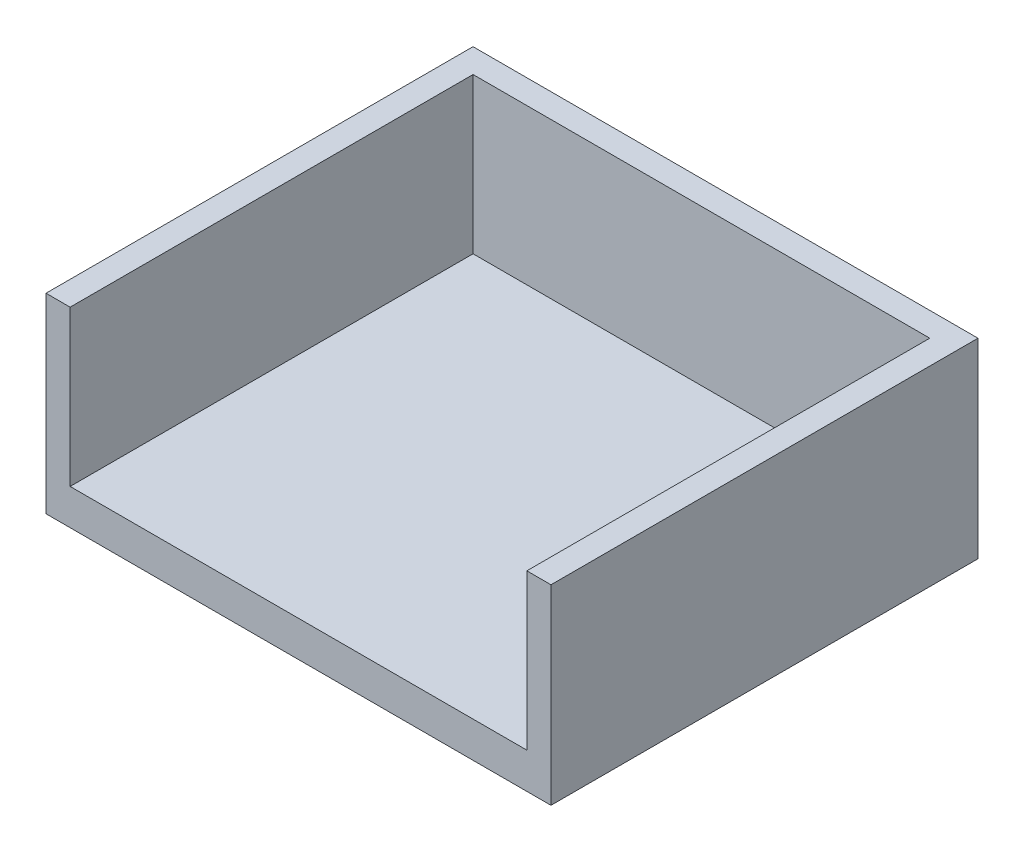
ISO-10303-21;
HEADER;
FILE_DESCRIPTION(('STEP AP214'),'2;1');
FILE_NAME('part.step','',(''),(''),'','','');
FILE_SCHEMA(('AUTOMOTIVE_DESIGN { 1 0 10303 214 1 1 1 1 }'));
ENDSEC;
DATA;
#1=APPLICATION_CONTEXT('core data for automotive mechanical design processes');
#2=APPLICATION_PROTOCOL_DEFINITION('international standard','automotive_design',2000,#1);
#3=PRODUCT_CONTEXT('',#1,'mechanical');
#4=PRODUCT('Part','Part','',(#3));
#5=PRODUCT_RELATED_PRODUCT_CATEGORY('part','',(#4));
#6=PRODUCT_DEFINITION_FORMATION('','',#4);
#7=PRODUCT_DEFINITION_CONTEXT('part definition',#1,'design');
#8=PRODUCT_DEFINITION('design','',#6,#7);
#9=PRODUCT_DEFINITION_SHAPE('','',#8);
#10=(LENGTH_UNIT() NAMED_UNIT(*) SI_UNIT(.MILLI.,.METRE.));
#11=(NAMED_UNIT(*) PLANE_ANGLE_UNIT() SI_UNIT($,.RADIAN.));
#12=(NAMED_UNIT(*) SI_UNIT($,.STERADIAN.) SOLID_ANGLE_UNIT());
#13=UNCERTAINTY_MEASURE_WITH_UNIT(LENGTH_MEASURE(1.E-05),#10,'distance_accuracy_value','');
#14=(GEOMETRIC_REPRESENTATION_CONTEXT(3) GLOBAL_UNCERTAINTY_ASSIGNED_CONTEXT((#13)) GLOBAL_UNIT_ASSIGNED_CONTEXT((#10,
#11,#12)) REPRESENTATION_CONTEXT('',''));
#15=CARTESIAN_POINT('',(0.,0.,0.));
#16=DIRECTION('',(0.,0.,1.));
#17=DIRECTION('',(1.,0.,0.));
#18=AXIS2_PLACEMENT_3D('',#15,#16,#17);
#19=CARTESIAN_POINT('',(-56.505,42.75,47.785));
#20=DIRECTION('',(1.,0.,0.));
#21=DIRECTION('',(0.,0.,-1.));
#22=AXIS2_PLACEMENT_3D('',#19,#20,#21);
#23=PLANE('',#22);
#24=DIRECTION('',(0.,0.,1.));
#25=VECTOR('',#24,1.);
#26=CARTESIAN_POINT('',(-56.505,0.,47.785));
#27=LINE('',#26,#25);
#28=CARTESIAN_POINT('',(-56.505,0.,-47.785));
#29=VERTEX_POINT('',#28);
#30=CARTESIAN_POINT('',(-56.505,0.,47.785));
#31=VERTEX_POINT('',#30);
#32=EDGE_CURVE('E158',#29,#31,#27,.T.);
#33=ORIENTED_EDGE('',*,*,#32,.T.);
#34=DIRECTION('',(0.,-1.,0.));
#35=VECTOR('',#34,1.);
#36=CARTESIAN_POINT('',(-56.505,42.75,47.785));
#37=LINE('',#36,#35);
#38=CARTESIAN_POINT('',(-56.505,42.75,47.785));
#39=VERTEX_POINT('',#38);
#40=EDGE_CURVE('E11',#39,#31,#37,.T.);
#41=ORIENTED_EDGE('',*,*,#40,.F.);
#42=DIRECTION('',(0.,0.,1.));
#43=VECTOR('',#42,1.);
#44=CARTESIAN_POINT('',(-56.505,42.75,47.785));
#45=LINE('',#44,#43);
#46=CARTESIAN_POINT('',(-56.505,42.75,-47.785));
#47=VERTEX_POINT('',#46);
#48=EDGE_CURVE('E145',#47,#39,#45,.T.);
#49=ORIENTED_EDGE('',*,*,#48,.F.);
#50=DIRECTION('',(0.,-1.,0.));
#51=VECTOR('',#50,1.);
#52=CARTESIAN_POINT('',(-56.505,42.75,-47.785));
#53=LINE('',#52,#51);
#54=EDGE_CURVE('E157',#47,#29,#53,.T.);
#55=ORIENTED_EDGE('',*,*,#54,.T.);
#56=EDGE_LOOP('',(#33,#41,#49,#55));
#57=FACE_BOUND('',#56,.T.);
#58=ADVANCED_FACE('F44',(#57),#23,.F.);
#59=CARTESIAN_POINT('',(56.505,42.75,47.785));
#60=DIRECTION('',(0.,0.,-1.));
#61=DIRECTION('',(-1.,0.,0.));
#62=AXIS2_PLACEMENT_3D('',#59,#60,#61);
#63=PLANE('',#62);
#64=DIRECTION('',(1.,0.,0.));
#65=VECTOR('',#64,1.);
#66=CARTESIAN_POINT('',(56.505,8.,47.785));
#67=LINE('',#66,#65);
#68=CARTESIAN_POINT('',(-51.105,8.,47.785));
#69=VERTEX_POINT('',#68);
#70=CARTESIAN_POINT('',(51.105,8.,47.785));
#71=VERTEX_POINT('',#70);
#72=EDGE_CURVE('E313',#69,#71,#67,.T.);
#73=ORIENTED_EDGE('',*,*,#72,.F.);
#74=DIRECTION('',(0.,1.,0.));
#75=VECTOR('',#74,1.);
#76=CARTESIAN_POINT('',(-51.105,42.75,47.785));
#77=LINE('',#76,#75);
#78=CARTESIAN_POINT('',(-51.105,42.75,47.785));
#79=VERTEX_POINT('',#78);
#80=EDGE_CURVE('E140',#69,#79,#77,.T.);
#81=ORIENTED_EDGE('',*,*,#80,.T.);
#82=DIRECTION('',(1.,0.,0.));
#83=VECTOR('',#82,1.);
#84=CARTESIAN_POINT('',(56.505,42.75,47.785));
#85=LINE('',#84,#83);
#86=EDGE_CURVE('E92',#39,#79,#85,.T.);
#87=ORIENTED_EDGE('',*,*,#86,.F.);
#88=ORIENTED_EDGE('',*,*,#40,.T.);
#89=DIRECTION('',(1.,0.,0.));
#90=VECTOR('',#89,1.);
#91=CARTESIAN_POINT('',(56.505,0.,47.785));
#92=LINE('',#91,#90);
#93=CARTESIAN_POINT('',(56.505,0.,47.785));
#94=VERTEX_POINT('',#93);
#95=EDGE_CURVE('E162',#31,#94,#92,.T.);
#96=ORIENTED_EDGE('',*,*,#95,.T.);
#97=DIRECTION('',(0.,-1.,0.));
#98=VECTOR('',#97,1.);
#99=CARTESIAN_POINT('',(56.505,42.75,47.785));
#100=LINE('',#99,#98);
#101=CARTESIAN_POINT('',(56.505,42.75,47.785));
#102=VERTEX_POINT('',#101);
#103=EDGE_CURVE('E53',#102,#94,#100,.T.);
#104=ORIENTED_EDGE('',*,*,#103,.F.);
#105=CARTESIAN_POINT('',(51.105,42.75,47.785));
#106=VERTEX_POINT('',#105);
#107=EDGE_CURVE('E122',#106,#102,#85,.T.);
#108=ORIENTED_EDGE('',*,*,#107,.F.);
#109=DIRECTION('',(0.,-1.,0.));
#110=VECTOR('',#109,1.);
#111=CARTESIAN_POINT('',(51.105,42.75,47.785));
#112=LINE('',#111,#110);
#113=EDGE_CURVE('E134',#106,#71,#112,.T.);
#114=ORIENTED_EDGE('',*,*,#113,.T.);
#115=EDGE_LOOP('',(#73,#81,#87,#88,#96,#104,#108,#114));
#116=FACE_BOUND('',#115,.T.);
#117=ADVANCED_FACE('F142',(#116),#63,.F.);
#118=CARTESIAN_POINT('',(56.505,42.75,47.785));
#119=DIRECTION('',(-1.,0.,0.));
#120=DIRECTION('',(0.,0.,1.));
#121=AXIS2_PLACEMENT_3D('',#118,#119,#120);
#122=PLANE('',#121);
#123=DIRECTION('',(0.,0.,-1.));
#124=VECTOR('',#123,1.);
#125=CARTESIAN_POINT('',(56.505,0.,47.785));
#126=LINE('',#125,#124);
#127=CARTESIAN_POINT('',(56.505,0.,-47.785));
#128=VERTEX_POINT('',#127);
#129=EDGE_CURVE('E79',#94,#128,#126,.T.);
#130=ORIENTED_EDGE('',*,*,#129,.T.);
#131=DIRECTION('',(0.,-1.,0.));
#132=VECTOR('',#131,1.);
#133=CARTESIAN_POINT('',(56.505,42.75,-47.785));
#134=LINE('',#133,#132);
#135=CARTESIAN_POINT('',(56.505,42.75,-47.785));
#136=VERTEX_POINT('',#135);
#137=EDGE_CURVE('E172',#136,#128,#134,.T.);
#138=ORIENTED_EDGE('',*,*,#137,.F.);
#139=DIRECTION('',(0.,0.,-1.));
#140=VECTOR('',#139,1.);
#141=CARTESIAN_POINT('',(56.505,42.75,47.785));
#142=LINE('',#141,#140);
#143=EDGE_CURVE('E149',#102,#136,#142,.T.);
#144=ORIENTED_EDGE('',*,*,#143,.F.);
#145=ORIENTED_EDGE('',*,*,#103,.T.);
#146=EDGE_LOOP('',(#130,#138,#144,#145));
#147=FACE_BOUND('',#146,.T.);
#148=ADVANCED_FACE('F175',(#147),#122,.F.);
#149=CARTESIAN_POINT('',(56.505,42.75,-47.785));
#150=DIRECTION('',(0.,0.,1.));
#151=DIRECTION('',(1.,0.,0.));
#152=AXIS2_PLACEMENT_3D('',#149,#150,#151);
#153=PLANE('',#152);
#154=DIRECTION('',(-1.,0.,0.));
#155=VECTOR('',#154,1.);
#156=CARTESIAN_POINT('',(56.505,0.,-47.785));
#157=LINE('',#156,#155);
#158=EDGE_CURVE('E85',#128,#29,#157,.T.);
#159=ORIENTED_EDGE('',*,*,#158,.T.);
#160=ORIENTED_EDGE('',*,*,#54,.F.);
#161=DIRECTION('',(-1.,0.,0.));
#162=VECTOR('',#161,1.);
#163=CARTESIAN_POINT('',(56.505,42.75,-47.785));
#164=LINE('',#163,#162);
#165=EDGE_CURVE('E61',#136,#47,#164,.T.);
#166=ORIENTED_EDGE('',*,*,#165,.F.);
#167=ORIENTED_EDGE('',*,*,#137,.T.);
#168=EDGE_LOOP('',(#159,#160,#166,#167));
#169=FACE_BOUND('',#168,.T.);
#170=ADVANCED_FACE('F182',(#169),#153,.F.);
#171=CARTESIAN_POINT('',(0.,42.75,0.));
#172=DIRECTION('',(0.,1.,0.));
#173=DIRECTION('',(0.,0.,1.));
#174=AXIS2_PLACEMENT_3D('',#171,#172,#173);
#175=PLANE('',#174);
#176=ORIENTED_EDGE('',*,*,#86,.T.);
#177=DIRECTION('',(0.,0.,1.));
#178=VECTOR('',#177,1.);
#179=CARTESIAN_POINT('',(-51.105,42.75,47.777303692476));
#180=LINE('',#179,#178);
#181=CARTESIAN_POINT('',(-51.105,42.75,-42.392696307524));
#182=VERTEX_POINT('',#181);
#183=EDGE_CURVE('E131',#182,#79,#180,.T.);
#184=ORIENTED_EDGE('',*,*,#183,.F.);
#185=DIRECTION('',(-1.,0.,0.));
#186=VECTOR('',#185,1.);
#187=CARTESIAN_POINT('',(51.105,42.75,-42.392696307524));
#188=LINE('',#187,#186);
#189=CARTESIAN_POINT('',(51.105,42.75,-42.392696307524));
#190=VERTEX_POINT('',#189);
#191=EDGE_CURVE('E126',#190,#182,#188,.T.);
#192=ORIENTED_EDGE('',*,*,#191,.F.);
#193=DIRECTION('',(0.,0.,-1.));
#194=VECTOR('',#193,1.);
#195=CARTESIAN_POINT('',(51.105,42.75,47.777303692476));
#196=LINE('',#195,#194);
#197=EDGE_CURVE('E118',#106,#190,#196,.T.);
#198=ORIENTED_EDGE('',*,*,#197,.F.);
#199=ORIENTED_EDGE('',*,*,#107,.T.);
#200=ORIENTED_EDGE('',*,*,#143,.T.);
#201=ORIENTED_EDGE('',*,*,#165,.T.);
#202=ORIENTED_EDGE('',*,*,#48,.T.);
#203=EDGE_LOOP('',(#176,#184,#192,#198,#199,#200,#201,#202));
#204=FACE_BOUND('',#203,.T.);
#205=ADVANCED_FACE('F120',(#204),#175,.T.);
#206=CARTESIAN_POINT('',(0.,0.,0.));
#207=DIRECTION('',(0.,1.,0.));
#208=DIRECTION('',(0.,0.,1.));
#209=AXIS2_PLACEMENT_3D('',#206,#207,#208);
#210=PLANE('',#209);
#211=ORIENTED_EDGE('',*,*,#32,.F.);
#212=ORIENTED_EDGE('',*,*,#158,.F.);
#213=ORIENTED_EDGE('',*,*,#129,.F.);
#214=ORIENTED_EDGE('',*,*,#95,.F.);
#215=EDGE_LOOP('',(#211,#212,#213,#214));
#216=FACE_BOUND('',#215,.T.);
#217=ADVANCED_FACE('F178',(#216),#210,.F.);
#218=CARTESIAN_POINT('',(-51.105,8.,47.777303692476));
#219=DIRECTION('',(-1.,0.,0.));
#220=DIRECTION('',(0.,0.,1.));
#221=AXIS2_PLACEMENT_3D('',#218,#219,#220);
#222=PLANE('',#221);
#223=ORIENTED_EDGE('',*,*,#183,.T.);
#224=ORIENTED_EDGE('',*,*,#80,.F.);
#225=DIRECTION('',(0.,0.,1.));
#226=VECTOR('',#225,1.);
#227=CARTESIAN_POINT('',(-51.105,8.,47.777303692476));
#228=LINE('',#227,#226);
#229=CARTESIAN_POINT('',(-51.105,8.,-42.392696307524));
#230=VERTEX_POINT('',#229);
#231=EDGE_CURVE('E320',#230,#69,#228,.T.);
#232=ORIENTED_EDGE('',*,*,#231,.F.);
#233=DIRECTION('',(0.,1.,0.));
#234=VECTOR('',#233,1.);
#235=CARTESIAN_POINT('',(-51.105,8.,-42.392696307524));
#236=LINE('',#235,#234);
#237=EDGE_CURVE('E163',#230,#182,#236,.T.);
#238=ORIENTED_EDGE('',*,*,#237,.T.);
#239=EDGE_LOOP('',(#223,#224,#232,#238));
#240=FACE_BOUND('',#239,.T.);
#241=ADVANCED_FACE('F235',(#240),#222,.F.);
#242=CARTESIAN_POINT('',(51.105,8.,-42.392696307524));
#243=DIRECTION('',(0.,0.,-1.));
#244=DIRECTION('',(-1.,0.,0.));
#245=AXIS2_PLACEMENT_3D('',#242,#243,#244);
#246=PLANE('',#245);
#247=ORIENTED_EDGE('',*,*,#191,.T.);
#248=ORIENTED_EDGE('',*,*,#237,.F.);
#249=DIRECTION('',(-1.,0.,0.));
#250=VECTOR('',#249,1.);
#251=CARTESIAN_POINT('',(51.105,8.,-42.392696307524));
#252=LINE('',#251,#250);
#253=CARTESIAN_POINT('',(51.105,8.,-42.392696307524));
#254=VERTEX_POINT('',#253);
#255=EDGE_CURVE('E325',#254,#230,#252,.T.);
#256=ORIENTED_EDGE('',*,*,#255,.F.);
#257=DIRECTION('',(0.,1.,0.));
#258=VECTOR('',#257,1.);
#259=CARTESIAN_POINT('',(51.105,8.,-42.392696307524));
#260=LINE('',#259,#258);
#261=EDGE_CURVE('E328',#254,#190,#260,.T.);
#262=ORIENTED_EDGE('',*,*,#261,.T.);
#263=EDGE_LOOP('',(#247,#248,#256,#262));
#264=FACE_BOUND('',#263,.T.);
#265=ADVANCED_FACE('F227',(#264),#246,.F.);
#266=CARTESIAN_POINT('',(51.105,8.,47.777303692476));
#267=DIRECTION('',(1.,0.,0.));
#268=DIRECTION('',(0.,0.,-1.));
#269=AXIS2_PLACEMENT_3D('',#266,#267,#268);
#270=PLANE('',#269);
#271=ORIENTED_EDGE('',*,*,#261,.F.);
#272=DIRECTION('',(0.,0.,-1.));
#273=VECTOR('',#272,1.);
#274=CARTESIAN_POINT('',(51.105,8.,47.777303692476));
#275=LINE('',#274,#273);
#276=EDGE_CURVE('E136',#71,#254,#275,.T.);
#277=ORIENTED_EDGE('',*,*,#276,.F.);
#278=ORIENTED_EDGE('',*,*,#113,.F.);
#279=ORIENTED_EDGE('',*,*,#197,.T.);
#280=EDGE_LOOP('',(#271,#277,#278,#279));
#281=FACE_BOUND('',#280,.T.);
#282=ADVANCED_FACE('F135',(#281),#270,.F.);
#283=CARTESIAN_POINT('',(0.,8.,0.));
#284=DIRECTION('',(0.,1.,0.));
#285=DIRECTION('',(0.,0.,1.));
#286=AXIS2_PLACEMENT_3D('',#283,#284,#285);
#287=PLANE('',#286);
#288=ORIENTED_EDGE('',*,*,#231,.T.);
#289=ORIENTED_EDGE('',*,*,#72,.T.);
#290=ORIENTED_EDGE('',*,*,#276,.T.);
#291=ORIENTED_EDGE('',*,*,#255,.T.);
#292=EDGE_LOOP('',(#288,#289,#290,#291));
#293=FACE_BOUND('',#292,.T.);
#294=ADVANCED_FACE('F214',(#293),#287,.T.);
#295=CLOSED_SHELL('',(#58,#117,#148,#170,#205,#217,#241,#265,#282,#294));
#296=MANIFOLD_SOLID_BREP('B2',#295);
#297=ADVANCED_BREP_SHAPE_REPRESENTATION('',(#18,#296),#14);
#298=SHAPE_DEFINITION_REPRESENTATION(#9,#297);
ENDSEC;
END-ISO-10303-21;
